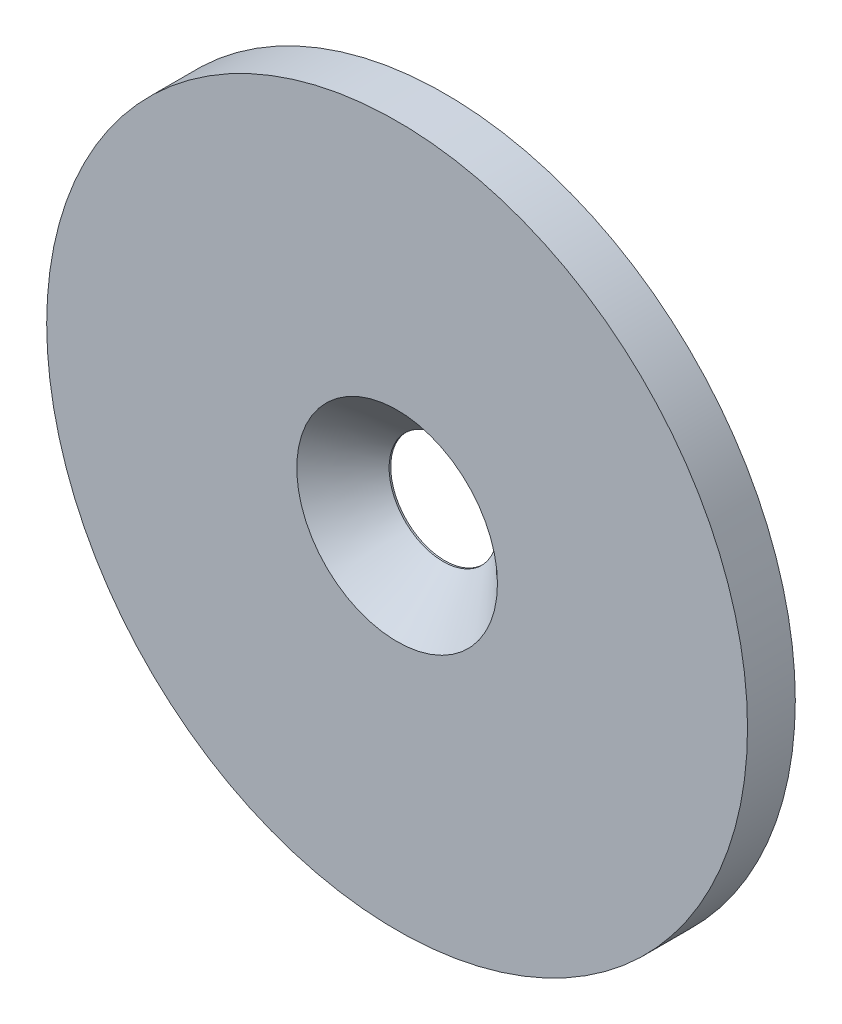
ISO-10303-21;
HEADER;
FILE_DESCRIPTION(('STEP AP214'),'2;1');
FILE_NAME('part.step','',(''),(''),'','','');
FILE_SCHEMA(('AUTOMOTIVE_DESIGN { 1 0 10303 214 1 1 1 1 }'));
ENDSEC;
DATA;
#1=APPLICATION_CONTEXT('core data for automotive mechanical design processes');
#2=APPLICATION_PROTOCOL_DEFINITION('international standard','automotive_design',2000,#1);
#3=PRODUCT_CONTEXT('',#1,'mechanical');
#4=PRODUCT('Part','Part','',(#3));
#5=PRODUCT_RELATED_PRODUCT_CATEGORY('part','',(#4));
#6=PRODUCT_DEFINITION_FORMATION('','',#4);
#7=PRODUCT_DEFINITION_CONTEXT('part definition',#1,'design');
#8=PRODUCT_DEFINITION('design','',#6,#7);
#9=PRODUCT_DEFINITION_SHAPE('','',#8);
#10=(LENGTH_UNIT() NAMED_UNIT(*) SI_UNIT(.MILLI.,.METRE.));
#11=(NAMED_UNIT(*) PLANE_ANGLE_UNIT() SI_UNIT($,.RADIAN.));
#12=(NAMED_UNIT(*) SI_UNIT($,.STERADIAN.) SOLID_ANGLE_UNIT());
#13=UNCERTAINTY_MEASURE_WITH_UNIT(LENGTH_MEASURE(1.E-05),#10,'distance_accuracy_value','');
#14=(GEOMETRIC_REPRESENTATION_CONTEXT(3) GLOBAL_UNCERTAINTY_ASSIGNED_CONTEXT((#13)) GLOBAL_UNIT_ASSIGNED_CONTEXT((#10,
#11,#12)) REPRESENTATION_CONTEXT('',''));
#15=CARTESIAN_POINT('',(0.,0.,0.));
#16=DIRECTION('',(0.,0.,1.));
#17=DIRECTION('',(1.,0.,0.));
#18=AXIS2_PLACEMENT_3D('',#15,#16,#17);
#19=CARTESIAN_POINT('',(0.,0.,1.5));
#20=DIRECTION('',(0.,0.,1.));
#21=DIRECTION('',(1.,0.,0.));
#22=AXIS2_PLACEMENT_3D('',#19,#20,#21);
#23=PLANE('',#22);
#24=CARTESIAN_POINT('',(0.,0.,1.5));
#25=DIRECTION('',(0.,0.,1.));
#26=DIRECTION('',(1.,0.,0.));
#27=AXIS2_PLACEMENT_3D('',#24,#25,#26);
#28=CIRCLE('',#27,3.15);
#29=CARTESIAN_POINT('',(3.15,0.,1.5));
#30=VERTEX_POINT('',#29);
#31=EDGE_CURVE('E49',#30,#30,#28,.T.);
#32=ORIENTED_EDGE('',*,*,#31,.F.);
#33=EDGE_LOOP('',(#32));
#34=FACE_BOUND('',#33,.T.);
#35=CARTESIAN_POINT('',(0.,0.,1.5));
#36=DIRECTION('',(0.,0.,1.));
#37=DIRECTION('',(1.,0.,0.));
#38=AXIS2_PLACEMENT_3D('',#35,#36,#37);
#39=CIRCLE('',#38,11.);
#40=CARTESIAN_POINT('',(11.,0.,1.5));
#41=VERTEX_POINT('',#40);
#42=EDGE_CURVE('E10',#41,#41,#39,.T.);
#43=ORIENTED_EDGE('',*,*,#42,.T.);
#44=EDGE_LOOP('',(#43));
#45=FACE_BOUND('',#44,.T.);
#46=ADVANCED_FACE('F31',(#34,#45),#23,.T.);
#47=CARTESIAN_POINT('',(0.,0.,0.));
#48=DIRECTION('',(0.,0.,1.));
#49=DIRECTION('',(1.,0.,0.));
#50=AXIS2_PLACEMENT_3D('',#47,#48,#49);
#51=PLANE('',#50);
#52=CARTESIAN_POINT('',(0.,0.,0.));
#53=DIRECTION('',(0.,0.,1.));
#54=DIRECTION('',(1.,0.,0.));
#55=AXIS2_PLACEMENT_3D('',#52,#53,#54);
#56=CIRCLE('',#55,1.7);
#57=CARTESIAN_POINT('',(1.7,0.,0.));
#58=VERTEX_POINT('',#57);
#59=EDGE_CURVE('E42',#58,#58,#56,.T.);
#60=ORIENTED_EDGE('',*,*,#59,.T.);
#61=EDGE_LOOP('',(#60));
#62=FACE_BOUND('',#61,.T.);
#63=CARTESIAN_POINT('',(0.,0.,0.));
#64=DIRECTION('',(0.,0.,1.));
#65=DIRECTION('',(1.,0.,0.));
#66=AXIS2_PLACEMENT_3D('',#63,#64,#65);
#67=CIRCLE('',#66,11.);
#68=CARTESIAN_POINT('',(11.,0.,0.));
#69=VERTEX_POINT('',#68);
#70=EDGE_CURVE('E35',#69,#69,#67,.T.);
#71=ORIENTED_EDGE('',*,*,#70,.F.);
#72=EDGE_LOOP('',(#71));
#73=FACE_BOUND('',#72,.T.);
#74=ADVANCED_FACE('F56',(#62,#73),#51,.F.);
#75=CARTESIAN_POINT('',(0.,0.,1.5));
#76=DIRECTION('',(0.,0.,-1.));
#77=DIRECTION('',(-1.,0.,0.));
#78=AXIS2_PLACEMENT_3D('',#75,#76,#77);
#79=CYLINDRICAL_SURFACE('',#78,11.);
#80=ORIENTED_EDGE('',*,*,#42,.F.);
#81=EDGE_LOOP('',(#80));
#82=FACE_BOUND('',#81,.T.);
#83=ORIENTED_EDGE('',*,*,#70,.T.);
#84=EDGE_LOOP('',(#83));
#85=FACE_BOUND('',#84,.T.);
#86=ADVANCED_FACE('F33',(#82,#85),#79,.T.);
#87=CARTESIAN_POINT('',(0.,0.,1.5));
#88=DIRECTION('',(0.,0.,1.));
#89=DIRECTION('',(1.,0.,0.));
#90=AXIS2_PLACEMENT_3D('',#87,#88,#89);
#91=CYLINDRICAL_SURFACE('',#90,1.7);
#92=ORIENTED_EDGE('',*,*,#59,.F.);
#93=EDGE_LOOP('',(#92));
#94=FACE_BOUND('',#93,.T.);
#95=CARTESIAN_POINT('',(0.,0.,0.0500000000000001));
#96=DIRECTION('',(0.,0.,1.));
#97=DIRECTION('',(1.,0.,0.));
#98=AXIS2_PLACEMENT_3D('',#95,#96,#97);
#99=CIRCLE('',#98,1.7);
#100=CARTESIAN_POINT('',(1.7,0.,0.0500000000000001));
#101=VERTEX_POINT('',#100);
#102=EDGE_CURVE('E46',#101,#101,#99,.T.);
#103=ORIENTED_EDGE('',*,*,#102,.T.);
#104=EDGE_LOOP('',(#103));
#105=FACE_BOUND('',#104,.T.);
#106=ADVANCED_FACE('F63',(#94,#105),#91,.F.);
#107=CARTESIAN_POINT('',(0.,0.,1.5));
#108=DIRECTION('',(0.,0.,1.));
#109=DIRECTION('',(1.,0.,0.));
#110=AXIS2_PLACEMENT_3D('',#107,#108,#109);
#111=CONICAL_SURFACE('',#110,3.15,0.785398163397448);
#112=ORIENTED_EDGE('',*,*,#102,.F.);
#113=EDGE_LOOP('',(#112));
#114=FACE_BOUND('',#113,.T.);
#115=ORIENTED_EDGE('',*,*,#31,.T.);
#116=EDGE_LOOP('',(#115));
#117=FACE_BOUND('',#116,.T.);
#118=ADVANCED_FACE('F53',(#114,#117),#111,.F.);
#119=CLOSED_SHELL('',(#46,#74,#86,#106,#118));
#120=MANIFOLD_SOLID_BREP('B2',#119);
#121=ADVANCED_BREP_SHAPE_REPRESENTATION('',(#18,#120),#14);
#122=SHAPE_DEFINITION_REPRESENTATION(#9,#121);
ENDSEC;
END-ISO-10303-21;
